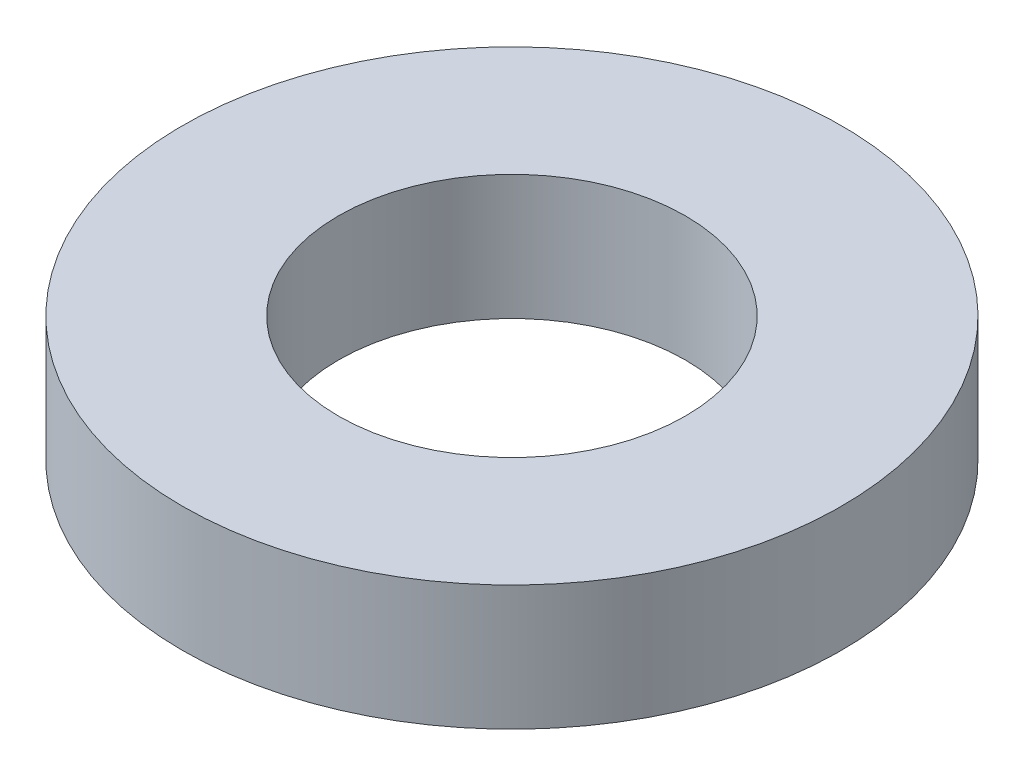
ISO-10303-21;
HEADER;
FILE_DESCRIPTION(('STEP AP214'),'2;1');
FILE_NAME('part.step','',(''),(''),'','','');
FILE_SCHEMA(('AUTOMOTIVE_DESIGN { 1 0 10303 214 1 1 1 1 }'));
ENDSEC;
DATA;
#1=APPLICATION_CONTEXT('core data for automotive mechanical design processes');
#2=APPLICATION_PROTOCOL_DEFINITION('international standard','automotive_design',2000,#1);
#3=PRODUCT_CONTEXT('',#1,'mechanical');
#4=PRODUCT('Part','Part','',(#3));
#5=PRODUCT_RELATED_PRODUCT_CATEGORY('part','',(#4));
#6=PRODUCT_DEFINITION_FORMATION('','',#4);
#7=PRODUCT_DEFINITION_CONTEXT('part definition',#1,'design');
#8=PRODUCT_DEFINITION('design','',#6,#7);
#9=PRODUCT_DEFINITION_SHAPE('','',#8);
#10=(LENGTH_UNIT() NAMED_UNIT(*) SI_UNIT(.MILLI.,.METRE.));
#11=(NAMED_UNIT(*) PLANE_ANGLE_UNIT() SI_UNIT($,.RADIAN.));
#12=(NAMED_UNIT(*) SI_UNIT($,.STERADIAN.) SOLID_ANGLE_UNIT());
#13=UNCERTAINTY_MEASURE_WITH_UNIT(LENGTH_MEASURE(1.E-05),#10,'distance_accuracy_value','');
#14=(GEOMETRIC_REPRESENTATION_CONTEXT(3) GLOBAL_UNCERTAINTY_ASSIGNED_CONTEXT((#13)) GLOBAL_UNIT_ASSIGNED_CONTEXT((#10,
#11,#12)) REPRESENTATION_CONTEXT('',''));
#15=CARTESIAN_POINT('',(0.,0.,0.));
#16=DIRECTION('',(0.,0.,1.));
#17=DIRECTION('',(1.,0.,0.));
#18=AXIS2_PLACEMENT_3D('',#15,#16,#17);
#19=CARTESIAN_POINT('',(0.,18.,0.));
#20=DIRECTION('',(0.,-1.,0.));
#21=DIRECTION('',(0.,0.,-1.));
#22=AXIS2_PLACEMENT_3D('',#19,#20,#21);
#23=CYLINDRICAL_SURFACE('',#22,47.5);
#24=CARTESIAN_POINT('',(0.,18.,0.));
#25=DIRECTION('',(0.,1.,0.));
#26=DIRECTION('',(0.,0.,1.));
#27=AXIS2_PLACEMENT_3D('',#24,#25,#26);
#28=CIRCLE('',#27,47.5);
#29=CARTESIAN_POINT('',(0.,18.,47.5));
#30=VERTEX_POINT('',#29);
#31=EDGE_CURVE('E10',#30,#30,#28,.T.);
#32=ORIENTED_EDGE('',*,*,#31,.F.);
#33=EDGE_LOOP('',(#32));
#34=FACE_BOUND('',#33,.T.);
#35=CARTESIAN_POINT('',(0.,0.,0.));
#36=DIRECTION('',(0.,1.,0.));
#37=DIRECTION('',(0.,0.,1.));
#38=AXIS2_PLACEMENT_3D('',#35,#36,#37);
#39=CIRCLE('',#38,47.5);
#40=CARTESIAN_POINT('',(0.,0.,47.5));
#41=VERTEX_POINT('',#40);
#42=EDGE_CURVE('E37',#41,#41,#39,.T.);
#43=ORIENTED_EDGE('',*,*,#42,.T.);
#44=EDGE_LOOP('',(#43));
#45=FACE_BOUND('',#44,.T.);
#46=ADVANCED_FACE('F40',(#34,#45),#23,.T.);
#47=CARTESIAN_POINT('',(0.,18.,0.));
#48=DIRECTION('',(0.,1.,0.));
#49=DIRECTION('',(0.,0.,1.));
#50=AXIS2_PLACEMENT_3D('',#47,#48,#49);
#51=PLANE('',#50);
#52=CARTESIAN_POINT('',(0.,18.,0.));
#53=DIRECTION('',(0.,1.,0.));
#54=DIRECTION('',(0.,0.,1.));
#55=AXIS2_PLACEMENT_3D('',#52,#53,#54);
#56=CIRCLE('',#55,25.);
#57=CARTESIAN_POINT('',(0.,18.,25.));
#58=VERTEX_POINT('',#57);
#59=EDGE_CURVE('E50',#58,#58,#56,.T.);
#60=ORIENTED_EDGE('',*,*,#59,.F.);
#61=EDGE_LOOP('',(#60));
#62=FACE_BOUND('',#61,.T.);
#63=ORIENTED_EDGE('',*,*,#31,.T.);
#64=EDGE_LOOP('',(#63));
#65=FACE_BOUND('',#64,.T.);
#66=ADVANCED_FACE('F59',(#62,#65),#51,.T.);
#67=CARTESIAN_POINT('',(0.,0.,0.));
#68=DIRECTION('',(0.,1.,0.));
#69=DIRECTION('',(0.,0.,1.));
#70=AXIS2_PLACEMENT_3D('',#67,#68,#69);
#71=PLANE('',#70);
#72=CARTESIAN_POINT('',(0.,0.,0.));
#73=DIRECTION('',(0.,1.,0.));
#74=DIRECTION('',(0.,0.,1.));
#75=AXIS2_PLACEMENT_3D('',#72,#73,#74);
#76=CIRCLE('',#75,25.);
#77=CARTESIAN_POINT('',(0.,0.,25.));
#78=VERTEX_POINT('',#77);
#79=EDGE_CURVE('E47',#78,#78,#76,.T.);
#80=ORIENTED_EDGE('',*,*,#79,.T.);
#81=EDGE_LOOP('',(#80));
#82=FACE_BOUND('',#81,.T.);
#83=ORIENTED_EDGE('',*,*,#42,.F.);
#84=EDGE_LOOP('',(#83));
#85=FACE_BOUND('',#84,.T.);
#86=ADVANCED_FACE('F58',(#82,#85),#71,.F.);
#87=CARTESIAN_POINT('',(0.,18.,0.));
#88=DIRECTION('',(0.,-1.,0.));
#89=DIRECTION('',(0.,0.,-1.));
#90=AXIS2_PLACEMENT_3D('',#87,#88,#89);
#91=CYLINDRICAL_SURFACE('',#90,25.);
#92=ORIENTED_EDGE('',*,*,#59,.T.);
#93=EDGE_LOOP('',(#92));
#94=FACE_BOUND('',#93,.T.);
#95=ORIENTED_EDGE('',*,*,#79,.F.);
#96=EDGE_LOOP('',(#95));
#97=FACE_BOUND('',#96,.T.);
#98=ADVANCED_FACE('F54',(#94,#97),#91,.F.);
#99=CLOSED_SHELL('',(#46,#66,#86,#98));
#100=MANIFOLD_SOLID_BREP('B2',#99);
#101=ADVANCED_BREP_SHAPE_REPRESENTATION('',(#18,#100),#14);
#102=SHAPE_DEFINITION_REPRESENTATION(#9,#101);
ENDSEC;
END-ISO-10303-21;
